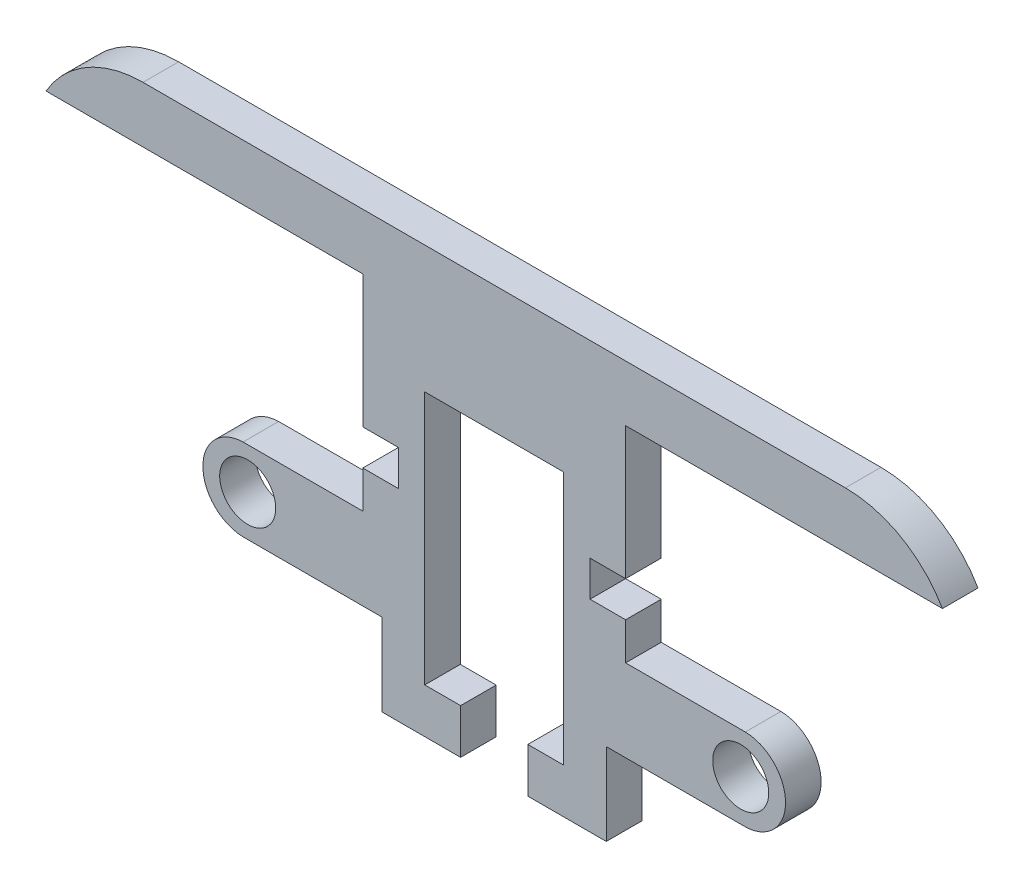
ISO-10303-21;
HEADER;
FILE_DESCRIPTION(('STEP AP214'),'2;1');
FILE_NAME('part.step','',(''),(''),'','','');
FILE_SCHEMA(('AUTOMOTIVE_DESIGN { 1 0 10303 214 1 1 1 1 }'));
ENDSEC;
DATA;
#1=APPLICATION_CONTEXT('core data for automotive mechanical design processes');
#2=APPLICATION_PROTOCOL_DEFINITION('international standard','automotive_design',2000,#1);
#3=PRODUCT_CONTEXT('',#1,'mechanical');
#4=PRODUCT('Part','Part','',(#3));
#5=PRODUCT_RELATED_PRODUCT_CATEGORY('part','',(#4));
#6=PRODUCT_DEFINITION_FORMATION('','',#4);
#7=PRODUCT_DEFINITION_CONTEXT('part definition',#1,'design');
#8=PRODUCT_DEFINITION('design','',#6,#7);
#9=PRODUCT_DEFINITION_SHAPE('','',#8);
#10=(LENGTH_UNIT() NAMED_UNIT(*) SI_UNIT(.MILLI.,.METRE.));
#11=(NAMED_UNIT(*) PLANE_ANGLE_UNIT() SI_UNIT($,.RADIAN.));
#12=(NAMED_UNIT(*) SI_UNIT($,.STERADIAN.) SOLID_ANGLE_UNIT());
#13=UNCERTAINTY_MEASURE_WITH_UNIT(LENGTH_MEASURE(1.E-05),#10,'distance_accuracy_value','');
#14=(GEOMETRIC_REPRESENTATION_CONTEXT(3) GLOBAL_UNCERTAINTY_ASSIGNED_CONTEXT((#13)) GLOBAL_UNIT_ASSIGNED_CONTEXT((#10,
#11,#12)) REPRESENTATION_CONTEXT('',''));
#15=CARTESIAN_POINT('',(0.,0.,0.));
#16=DIRECTION('',(0.,0.,1.));
#17=DIRECTION('',(1.,0.,0.));
#18=AXIS2_PLACEMENT_3D('',#15,#16,#17);
#19=CARTESIAN_POINT('',(0.,0.,3.175));
#20=DIRECTION('',(0.,0.,1.));
#21=DIRECTION('',(1.,0.,0.));
#22=AXIS2_PLACEMENT_3D('',#19,#20,#21);
#23=PLANE('',#22);
#24=CARTESIAN_POINT('',(-21.9999999999741,52.5623633111844,3.175));
#25=DIRECTION('',(0.,0.,1.));
#26=DIRECTION('',(1.,0.,0.));
#27=AXIS2_PLACEMENT_3D('',#24,#25,#26);
#28=CIRCLE('',#27,2.50000000002668);
#29=CARTESIAN_POINT('',(-19.4999999999474,52.5623633111844,3.175));
#30=VERTEX_POINT('',#29);
#31=EDGE_CURVE('E313',#30,#30,#28,.F.);
#32=ORIENTED_EDGE('',*,*,#31,.T.);
#33=EDGE_LOOP('',(#32));
#34=FACE_BOUND('',#33,.T.);
#35=CARTESIAN_POINT('',(21.9999999999741,52.5623633111844,3.175));
#36=DIRECTION('',(0.,0.,1.));
#37=DIRECTION('',(1.,0.,0.));
#38=AXIS2_PLACEMENT_3D('',#35,#36,#37);
#39=CIRCLE('',#38,2.50000000002668);
#40=CARTESIAN_POINT('',(24.5000000000008,52.5623633111844,3.175));
#41=VERTEX_POINT('',#40);
#42=EDGE_CURVE('E316',#41,#41,#39,.T.);
#43=ORIENTED_EDGE('',*,*,#42,.F.);
#44=EDGE_LOOP('',(#43));
#45=FACE_BOUND('',#44,.T.);
#46=DIRECTION('',(-1.,0.,0.));
#47=VECTOR('',#46,1.);
#48=CARTESIAN_POINT('',(0.,45.5623633111909,3.175));
#49=LINE('',#48,#47);
#50=CARTESIAN_POINT('',(6.2,45.5623633111909,3.175));
#51=VERTEX_POINT('',#50);
#52=CARTESIAN_POINT('',(3.,45.5623633111909,3.175));
#53=VERTEX_POINT('',#52);
#54=EDGE_CURVE('E282',#51,#53,#49,.T.);
#55=ORIENTED_EDGE('',*,*,#54,.T.);
#56=DIRECTION('',(0.,-1.,0.));
#57=VECTOR('',#56,1.);
#58=CARTESIAN_POINT('',(3.00000000000001,0.,3.175));
#59=LINE('',#58,#57);
#60=CARTESIAN_POINT('',(3.,41.5623633111909,3.175));
#61=VERTEX_POINT('',#60);
#62=EDGE_CURVE('E279',#53,#61,#59,.T.);
#63=ORIENTED_EDGE('',*,*,#62,.T.);
#64=DIRECTION('',(-1.,0.,0.));
#65=VECTOR('',#64,1.);
#66=CARTESIAN_POINT('',(0.,41.5623633111909,3.175));
#67=LINE('',#66,#65);
#68=CARTESIAN_POINT('',(10.,41.5623633111909,3.175));
#69=VERTEX_POINT('',#68);
#70=EDGE_CURVE('E309',#69,#61,#67,.T.);
#71=ORIENTED_EDGE('',*,*,#70,.F.);
#72=DIRECTION('',(0.,1.,0.));
#73=VECTOR('',#72,1.);
#74=CARTESIAN_POINT('',(10.,0.,3.175));
#75=LINE('',#74,#73);
#76=CARTESIAN_POINT('',(10.,48.895776139648,3.175));
#77=VERTEX_POINT('',#76);
#78=EDGE_CURVE('E330',#69,#77,#75,.T.);
#79=ORIENTED_EDGE('',*,*,#78,.T.);
#80=DIRECTION('',(1.,0.,0.));
#81=VECTOR('',#80,1.);
#82=CARTESIAN_POINT('',(0.,48.8957761396479,3.175));
#83=LINE('',#82,#81);
#84=CARTESIAN_POINT('',(22.4102695232923,48.895776139648,3.175));
#85=VERTEX_POINT('',#84);
#86=EDGE_CURVE('E332',#77,#85,#83,.T.);
#87=ORIENTED_EDGE('',*,*,#86,.T.);
#88=CARTESIAN_POINT('',(22.3325900721465,52.5623633111844,3.175));
#89=DIRECTION('',(0.,0.,1.));
#90=DIRECTION('',(1.,0.,0.));
#91=AXIS2_PLACEMENT_3D('',#88,#89,#90);
#92=CIRCLE('',#91,3.66740992849261);
#93=CARTESIAN_POINT('',(22.4102695232923,56.2289504827209,3.175));
#94=VERTEX_POINT('',#93);
#95=EDGE_CURVE('E334',#94,#85,#92,.F.);
#96=ORIENTED_EDGE('',*,*,#95,.F.);
#97=DIRECTION('',(1.,0.,0.));
#98=VECTOR('',#97,1.);
#99=CARTESIAN_POINT('',(0.,56.2289504827209,3.175));
#100=LINE('',#99,#98);
#101=CARTESIAN_POINT('',(11.7277945466856,56.2289504827209,3.175));
#102=VERTEX_POINT('',#101);
#103=EDGE_CURVE('E337',#102,#94,#100,.T.);
#104=ORIENTED_EDGE('',*,*,#103,.F.);
#105=DIRECTION('',(0.,-1.,0.));
#106=VECTOR('',#105,1.);
#107=CARTESIAN_POINT('',(11.7277945466856,0.,3.175));
#108=LINE('',#107,#106);
#109=CARTESIAN_POINT('',(11.7277945466856,59.5623633111909,3.175));
#110=VERTEX_POINT('',#109);
#111=EDGE_CURVE('E340',#110,#102,#108,.T.);
#112=ORIENTED_EDGE('',*,*,#111,.F.);
#113=DIRECTION('',(1.,0.,0.));
#114=VECTOR('',#113,1.);
#115=CARTESIAN_POINT('',(0.,59.5623633111909,3.175));
#116=LINE('',#115,#114);
#117=CARTESIAN_POINT('',(8.55279454668558,59.5623633111909,3.175));
#118=VERTEX_POINT('',#117);
#119=EDGE_CURVE('E343',#118,#110,#116,.T.);
#120=ORIENTED_EDGE('',*,*,#119,.F.);
#121=DIRECTION('',(0.,1.,0.));
#122=VECTOR('',#121,1.);
#123=CARTESIAN_POINT('',(8.55279454668558,0.,3.175));
#124=LINE('',#123,#122);
#125=CARTESIAN_POINT('',(8.55279454668558,62.7373633111909,3.175));
#126=VERTEX_POINT('',#125);
#127=EDGE_CURVE('E346',#118,#126,#124,.T.);
#128=ORIENTED_EDGE('',*,*,#127,.T.);
#129=DIRECTION('',(1.,0.,0.));
#130=VECTOR('',#129,1.);
#131=CARTESIAN_POINT('',(0.,62.7373633111909,3.175));
#132=LINE('',#131,#130);
#133=CARTESIAN_POINT('',(11.7277945466856,62.7373633111909,3.175));
#134=VERTEX_POINT('',#133);
#135=EDGE_CURVE('E348',#126,#134,#132,.T.);
#136=ORIENTED_EDGE('',*,*,#135,.T.);
#137=DIRECTION('',(0.,1.,0.));
#138=VECTOR('',#137,1.);
#139=CARTESIAN_POINT('',(11.7277945466856,0.,3.175));
#140=LINE('',#139,#138);
#141=CARTESIAN_POINT('',(11.7277945466856,74.5623633111909,3.175));
#142=VERTEX_POINT('',#141);
#143=EDGE_CURVE('E350',#134,#142,#140,.T.);
#144=ORIENTED_EDGE('',*,*,#143,.T.);
#145=DIRECTION('',(1.,0.,0.));
#146=VECTOR('',#145,1.);
#147=CARTESIAN_POINT('',(0.,74.5623633111909,3.175));
#148=LINE('',#147,#146);
#149=CARTESIAN_POINT('',(40.,74.5623633111909,3.175));
#150=VERTEX_POINT('',#149);
#151=EDGE_CURVE('E352',#142,#150,#148,.T.);
#152=ORIENTED_EDGE('',*,*,#151,.T.);
#153=CARTESIAN_POINT('',(31.3397459621556,69.5623633111909,3.175));
#154=DIRECTION('',(0.,0.,1.));
#155=DIRECTION('',(1.,0.,0.));
#156=AXIS2_PLACEMENT_3D('',#153,#154,#155);
#157=CIRCLE('',#156,10.);
#158=CARTESIAN_POINT('',(31.3397459621556,79.5623633111909,3.175));
#159=VERTEX_POINT('',#158);
#160=EDGE_CURVE('E493',#150,#159,#157,.T.);
#161=ORIENTED_EDGE('',*,*,#160,.T.);
#162=DIRECTION('',(1.,0.,0.));
#163=VECTOR('',#162,1.);
#164=CARTESIAN_POINT('',(0.,79.5623633111909,3.175));
#165=LINE('',#164,#163);
#166=CARTESIAN_POINT('',(-31.3397459621556,79.5623633111909,3.175));
#167=VERTEX_POINT('',#166);
#168=EDGE_CURVE('E354',#167,#159,#165,.T.);
#169=ORIENTED_EDGE('',*,*,#168,.F.);
#170=CARTESIAN_POINT('',(-31.3397459621556,69.5623633111909,3.175));
#171=DIRECTION('',(0.,0.,1.));
#172=DIRECTION('',(1.,0.,0.));
#173=AXIS2_PLACEMENT_3D('',#170,#171,#172);
#174=CIRCLE('',#173,10.);
#175=CARTESIAN_POINT('',(-40.,74.5623633111909,3.175));
#176=VERTEX_POINT('',#175);
#177=EDGE_CURVE('E494',#167,#176,#174,.T.);
#178=ORIENTED_EDGE('',*,*,#177,.T.);
#179=DIRECTION('',(-1.,0.,0.));
#180=VECTOR('',#179,1.);
#181=CARTESIAN_POINT('',(0.,74.5623633111909,3.175));
#182=LINE('',#181,#180);
#183=CARTESIAN_POINT('',(-11.7277945466856,74.5623633111909,3.175));
#184=VERTEX_POINT('',#183);
#185=EDGE_CURVE('E357',#184,#176,#182,.T.);
#186=ORIENTED_EDGE('',*,*,#185,.F.);
#187=DIRECTION('',(0.,1.,0.));
#188=VECTOR('',#187,1.);
#189=CARTESIAN_POINT('',(-11.7277945466856,0.,3.175));
#190=LINE('',#189,#188);
#191=CARTESIAN_POINT('',(-11.7277945466856,62.7373633111909,3.175));
#192=VERTEX_POINT('',#191);
#193=EDGE_CURVE('E360',#192,#184,#190,.T.);
#194=ORIENTED_EDGE('',*,*,#193,.F.);
#195=DIRECTION('',(-1.,0.,0.));
#196=VECTOR('',#195,1.);
#197=CARTESIAN_POINT('',(0.,62.7373633111909,3.175));
#198=LINE('',#197,#196);
#199=CARTESIAN_POINT('',(-8.55279454668558,62.7373633111909,3.175));
#200=VERTEX_POINT('',#199);
#201=EDGE_CURVE('E363',#200,#192,#198,.T.);
#202=ORIENTED_EDGE('',*,*,#201,.F.);
#203=DIRECTION('',(0.,1.,0.));
#204=VECTOR('',#203,1.);
#205=CARTESIAN_POINT('',(-8.55279454668552,0.,3.175));
#206=LINE('',#205,#204);
#207=CARTESIAN_POINT('',(-8.55279454668558,59.5623633111909,3.175));
#208=VERTEX_POINT('',#207);
#209=EDGE_CURVE('E366',#208,#200,#206,.T.);
#210=ORIENTED_EDGE('',*,*,#209,.F.);
#211=DIRECTION('',(1.,0.,0.));
#212=VECTOR('',#211,1.);
#213=CARTESIAN_POINT('',(0.,59.5623633111909,3.175));
#214=LINE('',#213,#212);
#215=CARTESIAN_POINT('',(-11.7277945466856,59.5623633111909,3.175));
#216=VERTEX_POINT('',#215);
#217=EDGE_CURVE('E369',#216,#208,#214,.T.);
#218=ORIENTED_EDGE('',*,*,#217,.F.);
#219=DIRECTION('',(0.,-1.,0.));
#220=VECTOR('',#219,1.);
#221=CARTESIAN_POINT('',(-11.7277945466856,0.,3.175));
#222=LINE('',#221,#220);
#223=CARTESIAN_POINT('',(-11.7277945466856,56.2289504827209,3.175));
#224=VERTEX_POINT('',#223);
#225=EDGE_CURVE('E372',#216,#224,#222,.T.);
#226=ORIENTED_EDGE('',*,*,#225,.T.);
#227=DIRECTION('',(-1.,0.,0.));
#228=VECTOR('',#227,1.);
#229=CARTESIAN_POINT('',(0.,56.2289504827209,3.175));
#230=LINE('',#229,#228);
#231=CARTESIAN_POINT('',(-22.4102695232923,56.2289504827209,3.175));
#232=VERTEX_POINT('',#231);
#233=EDGE_CURVE('E320',#224,#232,#230,.T.);
#234=ORIENTED_EDGE('',*,*,#233,.T.);
#235=CARTESIAN_POINT('',(-22.3325900721465,52.5623633111844,3.175));
#236=DIRECTION('',(0.,0.,1.));
#237=DIRECTION('',(1.,0.,0.));
#238=AXIS2_PLACEMENT_3D('',#235,#236,#237);
#239=CIRCLE('',#238,3.66740992849261);
#240=CARTESIAN_POINT('',(-22.4102695232923,48.895776139648,3.175));
#241=VERTEX_POINT('',#240);
#242=EDGE_CURVE('E323',#232,#241,#239,.T.);
#243=ORIENTED_EDGE('',*,*,#242,.T.);
#244=DIRECTION('',(-1.,0.,0.));
#245=VECTOR('',#244,1.);
#246=CARTESIAN_POINT('',(0.,48.8957761396479,3.175));
#247=LINE('',#246,#245);
#248=CARTESIAN_POINT('',(-10.,48.895776139648,3.175));
#249=VERTEX_POINT('',#248);
#250=EDGE_CURVE('E325',#249,#241,#247,.T.);
#251=ORIENTED_EDGE('',*,*,#250,.F.);
#252=DIRECTION('',(0.,1.,0.));
#253=VECTOR('',#252,1.);
#254=CARTESIAN_POINT('',(-9.99999999999997,0.,3.175));
#255=LINE('',#254,#253);
#256=CARTESIAN_POINT('',(-9.99999999999999,41.5623633111909,3.175));
#257=VERTEX_POINT('',#256);
#258=EDGE_CURVE('E328',#257,#249,#255,.T.);
#259=ORIENTED_EDGE('',*,*,#258,.F.);
#260=CARTESIAN_POINT('',(-2.99999999999999,41.5623633111909,3.175));
#261=VERTEX_POINT('',#260);
#262=EDGE_CURVE('E308',#261,#257,#67,.T.);
#263=ORIENTED_EDGE('',*,*,#262,.F.);
#264=DIRECTION('',(0.,-1.,0.));
#265=VECTOR('',#264,1.);
#266=CARTESIAN_POINT('',(-2.99999999999999,0.,3.175));
#267=LINE('',#266,#265);
#268=CARTESIAN_POINT('',(-2.99999999999999,45.5623633111909,3.175));
#269=VERTEX_POINT('',#268);
#270=EDGE_CURVE('E50',#269,#261,#267,.T.);
#271=ORIENTED_EDGE('',*,*,#270,.F.);
#272=DIRECTION('',(1.,0.,0.));
#273=VECTOR('',#272,1.);
#274=CARTESIAN_POINT('',(0.,45.5623633111909,3.175));
#275=LINE('',#274,#273);
#276=CARTESIAN_POINT('',(-6.2,45.5623633111909,3.175));
#277=VERTEX_POINT('',#276);
#278=EDGE_CURVE('E251',#277,#269,#275,.T.);
#279=ORIENTED_EDGE('',*,*,#278,.F.);
#280=DIRECTION('',(0.,-1.,0.));
#281=VECTOR('',#280,1.);
#282=CARTESIAN_POINT('',(-6.19999999999999,0.,3.175));
#283=LINE('',#282,#281);
#284=CARTESIAN_POINT('',(-6.2,68.2123633111909,3.175));
#285=VERTEX_POINT('',#284);
#286=EDGE_CURVE('E263',#285,#277,#283,.T.);
#287=ORIENTED_EDGE('',*,*,#286,.F.);
#288=DIRECTION('',(1.,0.,0.));
#289=VECTOR('',#288,1.);
#290=CARTESIAN_POINT('',(0.,68.2123633111909,3.175));
#291=LINE('',#290,#289);
#292=CARTESIAN_POINT('',(6.2,68.2123633111909,3.175));
#293=VERTEX_POINT('',#292);
#294=EDGE_CURVE('E266',#285,#293,#291,.T.);
#295=ORIENTED_EDGE('',*,*,#294,.T.);
#296=DIRECTION('',(0.,-1.,0.));
#297=VECTOR('',#296,1.);
#298=CARTESIAN_POINT('',(6.20000000000001,0.,3.175));
#299=LINE('',#298,#297);
#300=EDGE_CURVE('E285',#293,#51,#299,.T.);
#301=ORIENTED_EDGE('',*,*,#300,.T.);
#302=EDGE_LOOP('',(#55,#63,#71,#79,#87,#96,#104,#112,#120,#128,#136,#144,#152,#161,#169,#178,
#186,#194,#202,#210,#218,#226,#234,#243,#251,#259,#263,#271,#279,#287,#295,#301));
#303=FACE_BOUND('',#302,.T.);
#304=ADVANCED_FACE('F35',(#34,#45,#303),#23,.T.);
#305=CARTESIAN_POINT('',(0.,0.,0.));
#306=DIRECTION('',(0.,0.,1.));
#307=DIRECTION('',(1.,0.,0.));
#308=AXIS2_PLACEMENT_3D('',#305,#306,#307);
#309=PLANE('',#308);
#310=CARTESIAN_POINT('',(21.9999999999741,52.5623633111844,0.));
#311=DIRECTION('',(0.,0.,1.));
#312=DIRECTION('',(1.,0.,0.));
#313=AXIS2_PLACEMENT_3D('',#310,#311,#312);
#314=CIRCLE('',#313,2.50000000002668);
#315=CARTESIAN_POINT('',(24.5000000000008,52.5623633111844,0.));
#316=VERTEX_POINT('',#315);
#317=EDGE_CURVE('E377',#316,#316,#314,.T.);
#318=ORIENTED_EDGE('',*,*,#317,.T.);
#319=EDGE_LOOP('',(#318));
#320=FACE_BOUND('',#319,.T.);
#321=CARTESIAN_POINT('',(-21.9999999999741,52.5623633111844,0.));
#322=DIRECTION('',(0.,0.,1.));
#323=DIRECTION('',(1.,0.,0.));
#324=AXIS2_PLACEMENT_3D('',#321,#322,#323);
#325=CIRCLE('',#324,2.50000000002668);
#326=CARTESIAN_POINT('',(-19.4999999999474,52.5623633111844,0.));
#327=VERTEX_POINT('',#326);
#328=EDGE_CURVE('E312',#327,#327,#325,.F.);
#329=ORIENTED_EDGE('',*,*,#328,.F.);
#330=EDGE_LOOP('',(#329));
#331=FACE_BOUND('',#330,.T.);
#332=DIRECTION('',(0.,-1.,0.));
#333=VECTOR('',#332,1.);
#334=CARTESIAN_POINT('',(3.00000000000001,0.,0.));
#335=LINE('',#334,#333);
#336=CARTESIAN_POINT('',(3.,45.5623633111909,0.));
#337=VERTEX_POINT('',#336);
#338=CARTESIAN_POINT('',(3.,41.5623633111909,0.));
#339=VERTEX_POINT('',#338);
#340=EDGE_CURVE('E257',#337,#339,#335,.T.);
#341=ORIENTED_EDGE('',*,*,#340,.F.);
#342=DIRECTION('',(-1.,0.,0.));
#343=VECTOR('',#342,1.);
#344=CARTESIAN_POINT('',(0.,45.5623633111909,0.));
#345=LINE('',#344,#343);
#346=CARTESIAN_POINT('',(6.2,45.5623633111909,0.));
#347=VERTEX_POINT('',#346);
#348=EDGE_CURVE('E270',#347,#337,#345,.T.);
#349=ORIENTED_EDGE('',*,*,#348,.F.);
#350=DIRECTION('',(0.,-1.,0.));
#351=VECTOR('',#350,1.);
#352=CARTESIAN_POINT('',(6.20000000000001,0.,0.));
#353=LINE('',#352,#351);
#354=CARTESIAN_POINT('',(6.2,68.2123633111909,0.));
#355=VERTEX_POINT('',#354);
#356=EDGE_CURVE('E272',#355,#347,#353,.T.);
#357=ORIENTED_EDGE('',*,*,#356,.F.);
#358=DIRECTION('',(1.,0.,0.));
#359=VECTOR('',#358,1.);
#360=CARTESIAN_POINT('',(0.,68.2123633111909,0.));
#361=LINE('',#360,#359);
#362=CARTESIAN_POINT('',(-6.2,68.2123633111909,0.));
#363=VERTEX_POINT('',#362);
#364=EDGE_CURVE('E274',#363,#355,#361,.T.);
#365=ORIENTED_EDGE('',*,*,#364,.F.);
#366=DIRECTION('',(0.,-1.,0.));
#367=VECTOR('',#366,1.);
#368=CARTESIAN_POINT('',(-6.19999999999999,0.,0.));
#369=LINE('',#368,#367);
#370=CARTESIAN_POINT('',(-6.2,45.5623633111909,0.));
#371=VERTEX_POINT('',#370);
#372=EDGE_CURVE('E253',#363,#371,#369,.T.);
#373=ORIENTED_EDGE('',*,*,#372,.T.);
#374=DIRECTION('',(1.,0.,0.));
#375=VECTOR('',#374,1.);
#376=CARTESIAN_POINT('',(0.,45.5623633111909,0.));
#377=LINE('',#376,#375);
#378=CARTESIAN_POINT('',(-2.99999999999999,45.5623633111909,0.));
#379=VERTEX_POINT('',#378);
#380=EDGE_CURVE('E248',#371,#379,#377,.T.);
#381=ORIENTED_EDGE('',*,*,#380,.T.);
#382=DIRECTION('',(0.,-1.,0.));
#383=VECTOR('',#382,1.);
#384=CARTESIAN_POINT('',(-2.99999999999999,0.,0.));
#385=LINE('',#384,#383);
#386=CARTESIAN_POINT('',(-2.99999999999999,41.5623633111909,0.));
#387=VERTEX_POINT('',#386);
#388=EDGE_CURVE('E255',#379,#387,#385,.T.);
#389=ORIENTED_EDGE('',*,*,#388,.T.);
#390=DIRECTION('',(-1.,0.,0.));
#391=VECTOR('',#390,1.);
#392=CARTESIAN_POINT('',(0.,41.5623633111909,0.));
#393=LINE('',#392,#391);
#394=CARTESIAN_POINT('',(-9.99999999999999,41.5623633111909,0.));
#395=VERTEX_POINT('',#394);
#396=EDGE_CURVE('E43',#387,#395,#393,.T.);
#397=ORIENTED_EDGE('',*,*,#396,.T.);
#398=DIRECTION('',(0.,1.,0.));
#399=VECTOR('',#398,1.);
#400=CARTESIAN_POINT('',(-9.99999999999997,0.,0.));
#401=LINE('',#400,#399);
#402=CARTESIAN_POINT('',(-10.,48.895776139648,0.));
#403=VERTEX_POINT('',#402);
#404=EDGE_CURVE('E389',#395,#403,#401,.T.);
#405=ORIENTED_EDGE('',*,*,#404,.T.);
#406=DIRECTION('',(-1.,0.,0.));
#407=VECTOR('',#406,1.);
#408=CARTESIAN_POINT('',(0.,48.8957761396479,0.));
#409=LINE('',#408,#407);
#410=CARTESIAN_POINT('',(-22.4102695232923,48.895776139648,0.));
#411=VERTEX_POINT('',#410);
#412=EDGE_CURVE('E386',#403,#411,#409,.T.);
#413=ORIENTED_EDGE('',*,*,#412,.T.);
#414=CARTESIAN_POINT('',(-22.3325900721465,52.5623633111844,0.));
#415=DIRECTION('',(0.,0.,1.));
#416=DIRECTION('',(1.,0.,0.));
#417=AXIS2_PLACEMENT_3D('',#414,#415,#416);
#418=CIRCLE('',#417,3.66740992849261);
#419=CARTESIAN_POINT('',(-22.4102695232923,56.2289504827209,0.));
#420=VERTEX_POINT('',#419);
#421=EDGE_CURVE('E383',#420,#411,#418,.T.);
#422=ORIENTED_EDGE('',*,*,#421,.F.);
#423=DIRECTION('',(-1.,0.,0.));
#424=VECTOR('',#423,1.);
#425=CARTESIAN_POINT('',(0.,56.2289504827209,0.));
#426=LINE('',#425,#424);
#427=CARTESIAN_POINT('',(-11.7277945466856,56.2289504827209,0.));
#428=VERTEX_POINT('',#427);
#429=EDGE_CURVE('E380',#428,#420,#426,.T.);
#430=ORIENTED_EDGE('',*,*,#429,.F.);
#431=DIRECTION('',(0.,-1.,0.));
#432=VECTOR('',#431,1.);
#433=CARTESIAN_POINT('',(-11.7277945466856,0.,0.));
#434=LINE('',#433,#432);
#435=CARTESIAN_POINT('',(-11.7277945466856,59.5623633111909,0.));
#436=VERTEX_POINT('',#435);
#437=EDGE_CURVE('E317',#436,#428,#434,.T.);
#438=ORIENTED_EDGE('',*,*,#437,.F.);
#439=DIRECTION('',(1.,0.,0.));
#440=VECTOR('',#439,1.);
#441=CARTESIAN_POINT('',(0.,59.5623633111909,0.));
#442=LINE('',#441,#440);
#443=CARTESIAN_POINT('',(-8.55279454668558,59.5623633111909,0.));
#444=VERTEX_POINT('',#443);
#445=EDGE_CURVE('E432',#436,#444,#442,.T.);
#446=ORIENTED_EDGE('',*,*,#445,.T.);
#447=DIRECTION('',(0.,1.,0.));
#448=VECTOR('',#447,1.);
#449=CARTESIAN_POINT('',(-8.55279454668552,0.,0.));
#450=LINE('',#449,#448);
#451=CARTESIAN_POINT('',(-8.55279454668558,62.7373633111909,0.));
#452=VERTEX_POINT('',#451);
#453=EDGE_CURVE('E429',#444,#452,#450,.T.);
#454=ORIENTED_EDGE('',*,*,#453,.T.);
#455=DIRECTION('',(-1.,0.,0.));
#456=VECTOR('',#455,1.);
#457=CARTESIAN_POINT('',(0.,62.7373633111909,0.));
#458=LINE('',#457,#456);
#459=CARTESIAN_POINT('',(-11.7277945466856,62.7373633111909,0.));
#460=VERTEX_POINT('',#459);
#461=EDGE_CURVE('E426',#452,#460,#458,.T.);
#462=ORIENTED_EDGE('',*,*,#461,.T.);
#463=DIRECTION('',(0.,1.,0.));
#464=VECTOR('',#463,1.);
#465=CARTESIAN_POINT('',(-11.7277945466856,0.,0.));
#466=LINE('',#465,#464);
#467=CARTESIAN_POINT('',(-11.7277945466856,74.5623633111909,0.));
#468=VERTEX_POINT('',#467);
#469=EDGE_CURVE('E423',#460,#468,#466,.T.);
#470=ORIENTED_EDGE('',*,*,#469,.T.);
#471=DIRECTION('',(-1.,0.,0.));
#472=VECTOR('',#471,1.);
#473=CARTESIAN_POINT('',(0.,74.5623633111909,0.));
#474=LINE('',#473,#472);
#475=CARTESIAN_POINT('',(-40.,74.5623633111909,0.));
#476=VERTEX_POINT('',#475);
#477=EDGE_CURVE('E420',#468,#476,#474,.T.);
#478=ORIENTED_EDGE('',*,*,#477,.T.);
#479=CARTESIAN_POINT('',(-31.3397459621556,69.5623633111909,0.));
#480=DIRECTION('',(0.,0.,1.));
#481=DIRECTION('',(1.,0.,0.));
#482=AXIS2_PLACEMENT_3D('',#479,#480,#481);
#483=CIRCLE('',#482,10.);
#484=CARTESIAN_POINT('',(-31.3397459621556,79.5623633111909,0.));
#485=VERTEX_POINT('',#484);
#486=EDGE_CURVE('E486',#476,#485,#483,.F.);
#487=ORIENTED_EDGE('',*,*,#486,.T.);
#488=DIRECTION('',(1.,0.,0.));
#489=VECTOR('',#488,1.);
#490=CARTESIAN_POINT('',(0.,79.5623633111909,0.));
#491=LINE('',#490,#489);
#492=CARTESIAN_POINT('',(31.3397459621556,79.5623633111909,0.));
#493=VERTEX_POINT('',#492);
#494=EDGE_CURVE('E417',#485,#493,#491,.T.);
#495=ORIENTED_EDGE('',*,*,#494,.T.);
#496=CARTESIAN_POINT('',(31.3397459621556,69.5623633111909,0.));
#497=DIRECTION('',(0.,0.,1.));
#498=DIRECTION('',(1.,0.,0.));
#499=AXIS2_PLACEMENT_3D('',#496,#497,#498);
#500=CIRCLE('',#499,10.);
#501=CARTESIAN_POINT('',(40.,74.5623633111909,0.));
#502=VERTEX_POINT('',#501);
#503=EDGE_CURVE('E484',#493,#502,#500,.F.);
#504=ORIENTED_EDGE('',*,*,#503,.T.);
#505=DIRECTION('',(1.,0.,0.));
#506=VECTOR('',#505,1.);
#507=CARTESIAN_POINT('',(0.,74.5623633111909,0.));
#508=LINE('',#507,#506);
#509=CARTESIAN_POINT('',(11.7277945466856,74.5623633111909,0.));
#510=VERTEX_POINT('',#509);
#511=EDGE_CURVE('E414',#510,#502,#508,.T.);
#512=ORIENTED_EDGE('',*,*,#511,.F.);
#513=DIRECTION('',(0.,1.,0.));
#514=VECTOR('',#513,1.);
#515=CARTESIAN_POINT('',(11.7277945466856,0.,0.));
#516=LINE('',#515,#514);
#517=CARTESIAN_POINT('',(11.7277945466856,62.7373633111909,0.));
#518=VERTEX_POINT('',#517);
#519=EDGE_CURVE('E412',#518,#510,#516,.T.);
#520=ORIENTED_EDGE('',*,*,#519,.F.);
#521=DIRECTION('',(1.,0.,0.));
#522=VECTOR('',#521,1.);
#523=CARTESIAN_POINT('',(0.,62.7373633111909,0.));
#524=LINE('',#523,#522);
#525=CARTESIAN_POINT('',(8.55279454668558,62.7373633111909,0.));
#526=VERTEX_POINT('',#525);
#527=EDGE_CURVE('E410',#526,#518,#524,.T.);
#528=ORIENTED_EDGE('',*,*,#527,.F.);
#529=DIRECTION('',(0.,1.,0.));
#530=VECTOR('',#529,1.);
#531=CARTESIAN_POINT('',(8.55279454668558,0.,0.));
#532=LINE('',#531,#530);
#533=CARTESIAN_POINT('',(8.55279454668558,59.5623633111909,0.));
#534=VERTEX_POINT('',#533);
#535=EDGE_CURVE('E408',#534,#526,#532,.T.);
#536=ORIENTED_EDGE('',*,*,#535,.F.);
#537=DIRECTION('',(1.,0.,0.));
#538=VECTOR('',#537,1.);
#539=CARTESIAN_POINT('',(0.,59.5623633111909,0.));
#540=LINE('',#539,#538);
#541=CARTESIAN_POINT('',(11.7277945466856,59.5623633111909,0.));
#542=VERTEX_POINT('',#541);
#543=EDGE_CURVE('E405',#534,#542,#540,.T.);
#544=ORIENTED_EDGE('',*,*,#543,.T.);
#545=DIRECTION('',(0.,-1.,0.));
#546=VECTOR('',#545,1.);
#547=CARTESIAN_POINT('',(11.7277945466856,0.,0.));
#548=LINE('',#547,#546);
#549=CARTESIAN_POINT('',(11.7277945466856,56.2289504827209,0.));
#550=VERTEX_POINT('',#549);
#551=EDGE_CURVE('E402',#542,#550,#548,.T.);
#552=ORIENTED_EDGE('',*,*,#551,.T.);
#553=DIRECTION('',(1.,0.,0.));
#554=VECTOR('',#553,1.);
#555=CARTESIAN_POINT('',(0.,56.2289504827209,0.));
#556=LINE('',#555,#554);
#557=CARTESIAN_POINT('',(22.4102695232923,56.2289504827209,0.));
#558=VERTEX_POINT('',#557);
#559=EDGE_CURVE('E399',#550,#558,#556,.T.);
#560=ORIENTED_EDGE('',*,*,#559,.T.);
#561=CARTESIAN_POINT('',(22.3325900721465,52.5623633111844,0.));
#562=DIRECTION('',(0.,0.,1.));
#563=DIRECTION('',(1.,0.,0.));
#564=AXIS2_PLACEMENT_3D('',#561,#562,#563);
#565=CIRCLE('',#564,3.66740992849261);
#566=CARTESIAN_POINT('',(22.4102695232923,48.895776139648,0.));
#567=VERTEX_POINT('',#566);
#568=EDGE_CURVE('E396',#558,#567,#565,.F.);
#569=ORIENTED_EDGE('',*,*,#568,.T.);
#570=DIRECTION('',(1.,0.,0.));
#571=VECTOR('',#570,1.);
#572=CARTESIAN_POINT('',(0.,48.8957761396479,0.));
#573=LINE('',#572,#571);
#574=CARTESIAN_POINT('',(10.,48.895776139648,0.));
#575=VERTEX_POINT('',#574);
#576=EDGE_CURVE('E393',#575,#567,#573,.T.);
#577=ORIENTED_EDGE('',*,*,#576,.F.);
#578=DIRECTION('',(0.,1.,0.));
#579=VECTOR('',#578,1.);
#580=CARTESIAN_POINT('',(10.,0.,0.));
#581=LINE('',#580,#579);
#582=CARTESIAN_POINT('',(10.,41.5623633111909,0.));
#583=VERTEX_POINT('',#582);
#584=EDGE_CURVE('E391',#583,#575,#581,.T.);
#585=ORIENTED_EDGE('',*,*,#584,.F.);
#586=EDGE_CURVE('E12',#583,#339,#393,.T.);
#587=ORIENTED_EDGE('',*,*,#586,.T.);
#588=EDGE_LOOP('',(#341,#349,#357,#365,#373,#381,#389,#397,#405,#413,#422,#430,#438,#446,#454,
#462,#470,#478,#487,#495,#504,#512,#520,#528,#536,#544,#552,#560,#569,#577,#585,#587));
#589=FACE_BOUND('',#588,.T.);
#590=ADVANCED_FACE('F260',(#320,#331,#589),#309,.F.);
#591=CARTESIAN_POINT('',(0.,41.5623633111909,0.));
#592=DIRECTION('',(0.,1.,0.));
#593=DIRECTION('',(0.,0.,1.));
#594=AXIS2_PLACEMENT_3D('',#591,#592,#593);
#595=PLANE('',#594);
#596=DIRECTION('',(0.,0.,1.));
#597=VECTOR('',#596,1.);
#598=CARTESIAN_POINT('',(3.,41.5623633111909,0.));
#599=LINE('',#598,#597);
#600=EDGE_CURVE('E301',#339,#61,#599,.T.);
#601=ORIENTED_EDGE('',*,*,#600,.F.);
#602=ORIENTED_EDGE('',*,*,#586,.F.);
#603=DIRECTION('',(0.,0.,-1.));
#604=VECTOR('',#603,1.);
#605=CARTESIAN_POINT('',(10.,41.5623633111909,3.175));
#606=LINE('',#605,#604);
#607=EDGE_CURVE('E292',#69,#583,#606,.T.);
#608=ORIENTED_EDGE('',*,*,#607,.F.);
#609=ORIENTED_EDGE('',*,*,#70,.T.);
#610=EDGE_LOOP('',(#601,#602,#608,#609));
#611=FACE_BOUND('',#610,.T.);
#612=ADVANCED_FACE('F562',(#611),#595,.F.);
#613=CARTESIAN_POINT('',(0.,56.2289504827209,3.175));
#614=DIRECTION('',(0.,-1.,0.));
#615=DIRECTION('',(1.,0.,0.));
#616=AXIS2_PLACEMENT_3D('',#613,#614,#615);
#617=PLANE('',#616);
#618=ORIENTED_EDGE('',*,*,#429,.T.);
#619=DIRECTION('',(0.,0.,-1.));
#620=VECTOR('',#619,1.);
#621=CARTESIAN_POINT('',(-22.4102695232923,56.2289504827209,3.175));
#622=LINE('',#621,#620);
#623=EDGE_CURVE('E481',#232,#420,#622,.T.);
#624=ORIENTED_EDGE('',*,*,#623,.F.);
#625=ORIENTED_EDGE('',*,*,#233,.F.);
#626=DIRECTION('',(0.,0.,-1.));
#627=VECTOR('',#626,1.);
#628=CARTESIAN_POINT('',(-11.7277945466856,56.2289504827209,3.175));
#629=LINE('',#628,#627);
#630=EDGE_CURVE('E374',#224,#428,#629,.T.);
#631=ORIENTED_EDGE('',*,*,#630,.T.);
#632=EDGE_LOOP('',(#618,#624,#625,#631));
#633=FACE_BOUND('',#632,.T.);
#634=ADVANCED_FACE('F603',(#633),#617,.F.);
#635=CARTESIAN_POINT('',(-22.3325900721465,52.5623633111844,3.175));
#636=DIRECTION('',(0.,0.,-1.));
#637=DIRECTION('',(-1.,0.,0.));
#638=AXIS2_PLACEMENT_3D('',#635,#636,#637);
#639=CYLINDRICAL_SURFACE('',#638,3.66740992849261);
#640=ORIENTED_EDGE('',*,*,#421,.T.);
#641=DIRECTION('',(0.,0.,-1.));
#642=VECTOR('',#641,1.);
#643=CARTESIAN_POINT('',(-22.4102695232923,48.895776139648,3.175));
#644=LINE('',#643,#642);
#645=EDGE_CURVE('E479',#241,#411,#644,.T.);
#646=ORIENTED_EDGE('',*,*,#645,.F.);
#647=ORIENTED_EDGE('',*,*,#242,.F.);
#648=ORIENTED_EDGE('',*,*,#623,.T.);
#649=EDGE_LOOP('',(#640,#646,#647,#648));
#650=FACE_BOUND('',#649,.T.);
#651=ADVANCED_FACE('F599',(#650),#639,.T.);
#652=CARTESIAN_POINT('',(0.,48.8957761396479,3.175));
#653=DIRECTION('',(0.,-1.,0.));
#654=DIRECTION('',(1.,0.,0.));
#655=AXIS2_PLACEMENT_3D('',#652,#653,#654);
#656=PLANE('',#655);
#657=ORIENTED_EDGE('',*,*,#412,.F.);
#658=DIRECTION('',(0.,0.,-1.));
#659=VECTOR('',#658,1.);
#660=CARTESIAN_POINT('',(-10.,48.895776139648,3.175));
#661=LINE('',#660,#659);
#662=EDGE_CURVE('E476',#249,#403,#661,.T.);
#663=ORIENTED_EDGE('',*,*,#662,.F.);
#664=ORIENTED_EDGE('',*,*,#250,.T.);
#665=ORIENTED_EDGE('',*,*,#645,.T.);
#666=EDGE_LOOP('',(#657,#663,#664,#665));
#667=FACE_BOUND('',#666,.T.);
#668=ADVANCED_FACE('F596',(#667),#656,.T.);
#669=CARTESIAN_POINT('',(-9.99999999999997,0.,3.175));
#670=DIRECTION('',(-1.,0.,0.));
#671=DIRECTION('',(0.,-1.,0.));
#672=AXIS2_PLACEMENT_3D('',#669,#670,#671);
#673=PLANE('',#672);
#674=DIRECTION('',(0.,0.,-1.));
#675=VECTOR('',#674,1.);
#676=CARTESIAN_POINT('',(-9.99999999999999,41.5623633111909,3.175));
#677=LINE('',#676,#675);
#678=EDGE_CURVE('E306',#257,#395,#677,.T.);
#679=ORIENTED_EDGE('',*,*,#678,.F.);
#680=ORIENTED_EDGE('',*,*,#258,.T.);
#681=ORIENTED_EDGE('',*,*,#662,.T.);
#682=ORIENTED_EDGE('',*,*,#404,.F.);
#683=EDGE_LOOP('',(#679,#680,#681,#682));
#684=FACE_BOUND('',#683,.T.);
#685=ADVANCED_FACE('F591',(#684),#673,.T.);
#686=CARTESIAN_POINT('',(10.,0.,3.175));
#687=DIRECTION('',(-1.,0.,0.));
#688=DIRECTION('',(0.,-1.,0.));
#689=AXIS2_PLACEMENT_3D('',#686,#687,#688);
#690=PLANE('',#689);
#691=ORIENTED_EDGE('',*,*,#78,.F.);
#692=ORIENTED_EDGE('',*,*,#607,.T.);
#693=ORIENTED_EDGE('',*,*,#584,.T.);
#694=DIRECTION('',(0.,0.,-1.));
#695=VECTOR('',#694,1.);
#696=CARTESIAN_POINT('',(10.,48.895776139648,3.175));
#697=LINE('',#696,#695);
#698=EDGE_CURVE('E473',#77,#575,#697,.T.);
#699=ORIENTED_EDGE('',*,*,#698,.F.);
#700=EDGE_LOOP('',(#691,#692,#693,#699));
#701=FACE_BOUND('',#700,.T.);
#702=ADVANCED_FACE('F558',(#701),#690,.F.);
#703=CARTESIAN_POINT('',(0.,48.8957761396479,3.175));
#704=DIRECTION('',(0.,1.,0.));
#705=DIRECTION('',(-1.,0.,0.));
#706=AXIS2_PLACEMENT_3D('',#703,#704,#705);
#707=PLANE('',#706);
#708=ORIENTED_EDGE('',*,*,#576,.T.);
#709=DIRECTION('',(0.,0.,-1.));
#710=VECTOR('',#709,1.);
#711=CARTESIAN_POINT('',(22.4102695232923,48.895776139648,3.175));
#712=LINE('',#711,#710);
#713=EDGE_CURVE('E471',#85,#567,#712,.T.);
#714=ORIENTED_EDGE('',*,*,#713,.F.);
#715=ORIENTED_EDGE('',*,*,#86,.F.);
#716=ORIENTED_EDGE('',*,*,#698,.T.);
#717=EDGE_LOOP('',(#708,#714,#715,#716));
#718=FACE_BOUND('',#717,.T.);
#719=ADVANCED_FACE('F553',(#718),#707,.F.);
#720=CARTESIAN_POINT('',(22.3325900721465,52.5623633111844,3.175));
#721=DIRECTION('',(0.,0.,-1.));
#722=DIRECTION('',(-1.,0.,0.));
#723=AXIS2_PLACEMENT_3D('',#720,#721,#722);
#724=CYLINDRICAL_SURFACE('',#723,3.66740992849261);
#725=ORIENTED_EDGE('',*,*,#568,.F.);
#726=DIRECTION('',(0.,0.,-1.));
#727=VECTOR('',#726,1.);
#728=CARTESIAN_POINT('',(22.4102695232923,56.2289504827209,3.175));
#729=LINE('',#728,#727);
#730=EDGE_CURVE('E469',#94,#558,#729,.T.);
#731=ORIENTED_EDGE('',*,*,#730,.F.);
#732=ORIENTED_EDGE('',*,*,#95,.T.);
#733=ORIENTED_EDGE('',*,*,#713,.T.);
#734=EDGE_LOOP('',(#725,#731,#732,#733));
#735=FACE_BOUND('',#734,.T.);
#736=ADVANCED_FACE('F548',(#735),#724,.T.);
#737=CARTESIAN_POINT('',(0.,56.2289504827209,3.175));
#738=DIRECTION('',(0.,1.,0.));
#739=DIRECTION('',(-1.,0.,0.));
#740=AXIS2_PLACEMENT_3D('',#737,#738,#739);
#741=PLANE('',#740);
#742=ORIENTED_EDGE('',*,*,#559,.F.);
#743=DIRECTION('',(0.,0.,-1.));
#744=VECTOR('',#743,1.);
#745=CARTESIAN_POINT('',(11.7277945466856,56.2289504827209,3.175));
#746=LINE('',#745,#744);
#747=EDGE_CURVE('E467',#102,#550,#746,.T.);
#748=ORIENTED_EDGE('',*,*,#747,.F.);
#749=ORIENTED_EDGE('',*,*,#103,.T.);
#750=ORIENTED_EDGE('',*,*,#730,.T.);
#751=EDGE_LOOP('',(#742,#748,#749,#750));
#752=FACE_BOUND('',#751,.T.);
#753=ADVANCED_FACE('F544',(#752),#741,.T.);
#754=CARTESIAN_POINT('',(11.7277945466856,0.,3.175));
#755=DIRECTION('',(1.,0.,0.));
#756=DIRECTION('',(0.,0.,-1.));
#757=AXIS2_PLACEMENT_3D('',#754,#755,#756);
#758=PLANE('',#757);
#759=ORIENTED_EDGE('',*,*,#551,.F.);
#760=DIRECTION('',(0.,0.,-1.));
#761=VECTOR('',#760,1.);
#762=CARTESIAN_POINT('',(11.7277945466856,59.5623633111909,3.175));
#763=LINE('',#762,#761);
#764=EDGE_CURVE('E465',#110,#542,#763,.T.);
#765=ORIENTED_EDGE('',*,*,#764,.F.);
#766=ORIENTED_EDGE('',*,*,#111,.T.);
#767=ORIENTED_EDGE('',*,*,#747,.T.);
#768=EDGE_LOOP('',(#759,#765,#766,#767));
#769=FACE_BOUND('',#768,.T.);
#770=ADVANCED_FACE('F540',(#769),#758,.T.);
#771=CARTESIAN_POINT('',(0.,59.5623633111909,3.175));
#772=DIRECTION('',(0.,1.,0.));
#773=DIRECTION('',(0.,0.,1.));
#774=AXIS2_PLACEMENT_3D('',#771,#772,#773);
#775=PLANE('',#774);
#776=ORIENTED_EDGE('',*,*,#543,.F.);
#777=DIRECTION('',(0.,0.,-1.));
#778=VECTOR('',#777,1.);
#779=CARTESIAN_POINT('',(8.55279454668558,59.5623633111909,3.175));
#780=LINE('',#779,#778);
#781=EDGE_CURVE('E463',#118,#534,#780,.T.);
#782=ORIENTED_EDGE('',*,*,#781,.F.);
#783=ORIENTED_EDGE('',*,*,#119,.T.);
#784=ORIENTED_EDGE('',*,*,#764,.T.);
#785=EDGE_LOOP('',(#776,#782,#783,#784));
#786=FACE_BOUND('',#785,.T.);
#787=ADVANCED_FACE('F536',(#786),#775,.T.);
#788=CARTESIAN_POINT('',(8.55279454668558,0.,3.175));
#789=DIRECTION('',(-1.,0.,0.));
#790=DIRECTION('',(0.,0.,1.));
#791=AXIS2_PLACEMENT_3D('',#788,#789,#790);
#792=PLANE('',#791);
#793=ORIENTED_EDGE('',*,*,#535,.T.);
#794=DIRECTION('',(0.,0.,-1.));
#795=VECTOR('',#794,1.);
#796=CARTESIAN_POINT('',(8.55279454668558,62.7373633111909,3.175));
#797=LINE('',#796,#795);
#798=EDGE_CURVE('E460',#126,#526,#797,.T.);
#799=ORIENTED_EDGE('',*,*,#798,.F.);
#800=ORIENTED_EDGE('',*,*,#127,.F.);
#801=ORIENTED_EDGE('',*,*,#781,.T.);
#802=EDGE_LOOP('',(#793,#799,#800,#801));
#803=FACE_BOUND('',#802,.T.);
#804=ADVANCED_FACE('F533',(#803),#792,.F.);
#805=CARTESIAN_POINT('',(0.,62.7373633111909,3.175));
#806=DIRECTION('',(0.,1.,0.));
#807=DIRECTION('',(0.,0.,1.));
#808=AXIS2_PLACEMENT_3D('',#805,#806,#807);
#809=PLANE('',#808);
#810=ORIENTED_EDGE('',*,*,#527,.T.);
#811=DIRECTION('',(0.,0.,-1.));
#812=VECTOR('',#811,1.);
#813=CARTESIAN_POINT('',(11.7277945466856,62.7373633111909,3.175));
#814=LINE('',#813,#812);
#815=EDGE_CURVE('E457',#134,#518,#814,.T.);
#816=ORIENTED_EDGE('',*,*,#815,.F.);
#817=ORIENTED_EDGE('',*,*,#135,.F.);
#818=ORIENTED_EDGE('',*,*,#798,.T.);
#819=EDGE_LOOP('',(#810,#816,#817,#818));
#820=FACE_BOUND('',#819,.T.);
#821=ADVANCED_FACE('F528',(#820),#809,.F.);
#822=CARTESIAN_POINT('',(11.7277945466856,0.,3.175));
#823=DIRECTION('',(-1.,0.,0.));
#824=DIRECTION('',(0.,0.,1.));
#825=AXIS2_PLACEMENT_3D('',#822,#823,#824);
#826=PLANE('',#825);
#827=ORIENTED_EDGE('',*,*,#519,.T.);
#828=DIRECTION('',(0.,0.,-1.));
#829=VECTOR('',#828,1.);
#830=CARTESIAN_POINT('',(11.7277945466856,74.5623633111909,3.175));
#831=LINE('',#830,#829);
#832=EDGE_CURVE('E454',#142,#510,#831,.T.);
#833=ORIENTED_EDGE('',*,*,#832,.F.);
#834=ORIENTED_EDGE('',*,*,#143,.F.);
#835=ORIENTED_EDGE('',*,*,#815,.T.);
#836=EDGE_LOOP('',(#827,#833,#834,#835));
#837=FACE_BOUND('',#836,.T.);
#838=ADVANCED_FACE('F522',(#837),#826,.F.);
#839=CARTESIAN_POINT('',(0.,74.5623633111909,3.175));
#840=DIRECTION('',(0.,1.,0.));
#841=DIRECTION('',(0.,0.,1.));
#842=AXIS2_PLACEMENT_3D('',#839,#840,#841);
#843=PLANE('',#842);
#844=ORIENTED_EDGE('',*,*,#511,.T.);
#845=DIRECTION('',(0.,0.,-1.));
#846=VECTOR('',#845,1.);
#847=CARTESIAN_POINT('',(40.,74.5623633111909,3.175));
#848=LINE('',#847,#846);
#849=EDGE_CURVE('E451',#150,#502,#848,.T.);
#850=ORIENTED_EDGE('',*,*,#849,.F.);
#851=ORIENTED_EDGE('',*,*,#151,.F.);
#852=ORIENTED_EDGE('',*,*,#832,.T.);
#853=EDGE_LOOP('',(#844,#850,#851,#852));
#854=FACE_BOUND('',#853,.T.);
#855=ADVANCED_FACE('F517',(#854),#843,.F.);
#856=CARTESIAN_POINT('',(0.,79.5623633111909,3.175));
#857=DIRECTION('',(0.,1.,0.));
#858=DIRECTION('',(0.,0.,1.));
#859=AXIS2_PLACEMENT_3D('',#856,#857,#858);
#860=PLANE('',#859);
#861=ORIENTED_EDGE('',*,*,#494,.F.);
#862=DIRECTION('',(0.,0.,-1.));
#863=VECTOR('',#862,1.);
#864=CARTESIAN_POINT('',(-31.3397459621556,79.5623633111909,3.175));
#865=LINE('',#864,#863);
#866=EDGE_CURVE('E491',#485,#167,#865,.F.);
#867=ORIENTED_EDGE('',*,*,#866,.T.);
#868=ORIENTED_EDGE('',*,*,#168,.T.);
#869=DIRECTION('',(0.,0.,1.));
#870=VECTOR('',#869,1.);
#871=CARTESIAN_POINT('',(31.3397459621556,79.5623633111909,0.));
#872=LINE('',#871,#870);
#873=EDGE_CURVE('E488',#159,#493,#872,.F.);
#874=ORIENTED_EDGE('',*,*,#873,.T.);
#875=EDGE_LOOP('',(#861,#867,#868,#874));
#876=FACE_BOUND('',#875,.T.);
#877=ADVANCED_FACE('F509',(#876),#860,.T.);
#878=CARTESIAN_POINT('',(0.,74.5623633111909,3.175));
#879=DIRECTION('',(0.,-1.,0.));
#880=DIRECTION('',(0.,0.,-1.));
#881=AXIS2_PLACEMENT_3D('',#878,#879,#880);
#882=PLANE('',#881);
#883=ORIENTED_EDGE('',*,*,#477,.F.);
#884=DIRECTION('',(0.,0.,-1.));
#885=VECTOR('',#884,1.);
#886=CARTESIAN_POINT('',(-11.7277945466856,74.5623633111909,3.175));
#887=LINE('',#886,#885);
#888=EDGE_CURVE('E446',#184,#468,#887,.T.);
#889=ORIENTED_EDGE('',*,*,#888,.F.);
#890=ORIENTED_EDGE('',*,*,#185,.T.);
#891=DIRECTION('',(0.,0.,-1.));
#892=VECTOR('',#891,1.);
#893=CARTESIAN_POINT('',(-40.,74.5623633111909,3.175));
#894=LINE('',#893,#892);
#895=EDGE_CURVE('E448',#176,#476,#894,.T.);
#896=ORIENTED_EDGE('',*,*,#895,.T.);
#897=EDGE_LOOP('',(#883,#889,#890,#896));
#898=FACE_BOUND('',#897,.T.);
#899=ADVANCED_FACE('F505',(#898),#882,.T.);
#900=CARTESIAN_POINT('',(-11.7277945466856,0.,3.175));
#901=DIRECTION('',(-1.,0.,0.));
#902=DIRECTION('',(0.,0.,1.));
#903=AXIS2_PLACEMENT_3D('',#900,#901,#902);
#904=PLANE('',#903);
#905=ORIENTED_EDGE('',*,*,#469,.F.);
#906=DIRECTION('',(0.,0.,-1.));
#907=VECTOR('',#906,1.);
#908=CARTESIAN_POINT('',(-11.7277945466856,62.7373633111909,3.175));
#909=LINE('',#908,#907);
#910=EDGE_CURVE('E444',#192,#460,#909,.T.);
#911=ORIENTED_EDGE('',*,*,#910,.F.);
#912=ORIENTED_EDGE('',*,*,#193,.T.);
#913=ORIENTED_EDGE('',*,*,#888,.T.);
#914=EDGE_LOOP('',(#905,#911,#912,#913));
#915=FACE_BOUND('',#914,.T.);
#916=ADVANCED_FACE('F622',(#915),#904,.T.);
#917=CARTESIAN_POINT('',(0.,62.7373633111909,3.175));
#918=DIRECTION('',(0.,-1.,0.));
#919=DIRECTION('',(0.,0.,-1.));
#920=AXIS2_PLACEMENT_3D('',#917,#918,#919);
#921=PLANE('',#920);
#922=ORIENTED_EDGE('',*,*,#461,.F.);
#923=DIRECTION('',(0.,0.,-1.));
#924=VECTOR('',#923,1.);
#925=CARTESIAN_POINT('',(-8.55279454668558,62.7373633111909,3.175));
#926=LINE('',#925,#924);
#927=EDGE_CURVE('E442',#200,#452,#926,.T.);
#928=ORIENTED_EDGE('',*,*,#927,.F.);
#929=ORIENTED_EDGE('',*,*,#201,.T.);
#930=ORIENTED_EDGE('',*,*,#910,.T.);
#931=EDGE_LOOP('',(#922,#928,#929,#930));
#932=FACE_BOUND('',#931,.T.);
#933=ADVANCED_FACE('F619',(#932),#921,.T.);
#934=CARTESIAN_POINT('',(-8.55279454668552,0.,3.175));
#935=DIRECTION('',(-1.,0.,0.));
#936=DIRECTION('',(0.,-1.,0.));
#937=AXIS2_PLACEMENT_3D('',#934,#935,#936);
#938=PLANE('',#937);
#939=ORIENTED_EDGE('',*,*,#453,.F.);
#940=DIRECTION('',(0.,0.,-1.));
#941=VECTOR('',#940,1.);
#942=CARTESIAN_POINT('',(-8.55279454668558,59.5623633111909,3.175));
#943=LINE('',#942,#941);
#944=EDGE_CURVE('E440',#208,#444,#943,.T.);
#945=ORIENTED_EDGE('',*,*,#944,.F.);
#946=ORIENTED_EDGE('',*,*,#209,.T.);
#947=ORIENTED_EDGE('',*,*,#927,.T.);
#948=EDGE_LOOP('',(#939,#945,#946,#947));
#949=FACE_BOUND('',#948,.T.);
#950=ADVANCED_FACE('F615',(#949),#938,.T.);
#951=CARTESIAN_POINT('',(0.,59.5623633111909,3.175));
#952=DIRECTION('',(0.,1.,0.));
#953=DIRECTION('',(0.,0.,1.));
#954=AXIS2_PLACEMENT_3D('',#951,#952,#953);
#955=PLANE('',#954);
#956=ORIENTED_EDGE('',*,*,#445,.F.);
#957=DIRECTION('',(0.,0.,-1.));
#958=VECTOR('',#957,1.);
#959=CARTESIAN_POINT('',(-11.7277945466856,59.5623633111909,3.175));
#960=LINE('',#959,#958);
#961=EDGE_CURVE('E438',#216,#436,#960,.T.);
#962=ORIENTED_EDGE('',*,*,#961,.F.);
#963=ORIENTED_EDGE('',*,*,#217,.T.);
#964=ORIENTED_EDGE('',*,*,#944,.T.);
#965=EDGE_LOOP('',(#956,#962,#963,#964));
#966=FACE_BOUND('',#965,.T.);
#967=ADVANCED_FACE('F609',(#966),#955,.T.);
#968=CARTESIAN_POINT('',(-11.7277945466856,0.,3.175));
#969=DIRECTION('',(1.,0.,0.));
#970=DIRECTION('',(0.,0.,-1.));
#971=AXIS2_PLACEMENT_3D('',#968,#969,#970);
#972=PLANE('',#971);
#973=ORIENTED_EDGE('',*,*,#437,.T.);
#974=ORIENTED_EDGE('',*,*,#630,.F.);
#975=ORIENTED_EDGE('',*,*,#225,.F.);
#976=ORIENTED_EDGE('',*,*,#961,.T.);
#977=EDGE_LOOP('',(#973,#974,#975,#976));
#978=FACE_BOUND('',#977,.T.);
#979=ADVANCED_FACE('F623',(#978),#972,.F.);
#980=CARTESIAN_POINT('',(21.9999999999741,52.5623633111844,3.175));
#981=DIRECTION('',(0.,0.,-1.));
#982=DIRECTION('',(-1.,0.,0.));
#983=AXIS2_PLACEMENT_3D('',#980,#981,#982);
#984=CYLINDRICAL_SURFACE('',#983,2.50000000002668);
#985=ORIENTED_EDGE('',*,*,#42,.T.);
#986=EDGE_LOOP('',(#985));
#987=FACE_BOUND('',#986,.T.);
#988=ORIENTED_EDGE('',*,*,#317,.F.);
#989=EDGE_LOOP('',(#988));
#990=FACE_BOUND('',#989,.T.);
#991=ADVANCED_FACE('F625',(#987,#990),#984,.F.);
#992=CARTESIAN_POINT('',(-21.9999999999741,52.5623633111844,3.175));
#993=DIRECTION('',(0.,0.,-1.));
#994=DIRECTION('',(-1.,0.,0.));
#995=AXIS2_PLACEMENT_3D('',#992,#993,#994);
#996=CYLINDRICAL_SURFACE('',#995,2.50000000002668);
#997=ORIENTED_EDGE('',*,*,#31,.F.);
#998=EDGE_LOOP('',(#997));
#999=FACE_BOUND('',#998,.T.);
#1000=ORIENTED_EDGE('',*,*,#328,.T.);
#1001=EDGE_LOOP('',(#1000));
#1002=FACE_BOUND('',#1001,.T.);
#1003=ADVANCED_FACE('F631',(#999,#1002),#996,.F.);
#1004=CARTESIAN_POINT('',(-31.3397459621556,69.5623633111909,3.175));
#1005=DIRECTION('',(0.,0.,1.));
#1006=DIRECTION('',(1.,0.,0.));
#1007=AXIS2_PLACEMENT_3D('',#1004,#1005,#1006);
#1008=CYLINDRICAL_SURFACE('',#1007,10.);
#1009=ORIENTED_EDGE('',*,*,#177,.F.);
#1010=ORIENTED_EDGE('',*,*,#866,.F.);
#1011=ORIENTED_EDGE('',*,*,#486,.F.);
#1012=ORIENTED_EDGE('',*,*,#895,.F.);
#1013=EDGE_LOOP('',(#1009,#1010,#1011,#1012));
#1014=FACE_BOUND('',#1013,.T.);
#1015=ADVANCED_FACE('F506',(#1014),#1008,.T.);
#1016=CARTESIAN_POINT('',(31.3397459621556,69.5623633111909,3.175));
#1017=DIRECTION('',(0.,0.,-1.));
#1018=DIRECTION('',(-1.,0.,0.));
#1019=AXIS2_PLACEMENT_3D('',#1016,#1017,#1018);
#1020=CYLINDRICAL_SURFACE('',#1019,10.);
#1021=ORIENTED_EDGE('',*,*,#160,.F.);
#1022=ORIENTED_EDGE('',*,*,#849,.T.);
#1023=ORIENTED_EDGE('',*,*,#503,.F.);
#1024=ORIENTED_EDGE('',*,*,#873,.F.);
#1025=EDGE_LOOP('',(#1021,#1022,#1023,#1024));
#1026=FACE_BOUND('',#1025,.T.);
#1027=ADVANCED_FACE('F37',(#1026),#1020,.T.);
#1028=ORIENTED_EDGE('',*,*,#396,.F.);
#1029=DIRECTION('',(0.,0.,1.));
#1030=VECTOR('',#1029,1.);
#1031=CARTESIAN_POINT('',(-2.99999999999999,41.5623633111909,0.));
#1032=LINE('',#1031,#1030);
#1033=EDGE_CURVE('E252',#387,#261,#1032,.T.);
#1034=ORIENTED_EDGE('',*,*,#1033,.T.);
#1035=ORIENTED_EDGE('',*,*,#262,.T.);
#1036=ORIENTED_EDGE('',*,*,#678,.T.);
#1037=EDGE_LOOP('',(#1028,#1034,#1035,#1036));
#1038=FACE_BOUND('',#1037,.T.);
#1039=ADVANCED_FACE('F588',(#1038),#595,.F.);
#1040=CARTESIAN_POINT('',(0.,45.5623633111909,0.));
#1041=DIRECTION('',(0.,-1.,0.));
#1042=DIRECTION('',(0.,0.,-1.));
#1043=AXIS2_PLACEMENT_3D('',#1040,#1041,#1042);
#1044=PLANE('',#1043);
#1045=ORIENTED_EDGE('',*,*,#278,.T.);
#1046=DIRECTION('',(0.,0.,1.));
#1047=VECTOR('',#1046,1.);
#1048=CARTESIAN_POINT('',(-2.99999999999999,45.5623633111909,0.));
#1049=LINE('',#1048,#1047);
#1050=EDGE_CURVE('E244',#379,#269,#1049,.T.);
#1051=ORIENTED_EDGE('',*,*,#1050,.F.);
#1052=ORIENTED_EDGE('',*,*,#380,.F.);
#1053=DIRECTION('',(0.,0.,1.));
#1054=VECTOR('',#1053,1.);
#1055=CARTESIAN_POINT('',(-6.2,45.5623633111909,0.));
#1056=LINE('',#1055,#1054);
#1057=EDGE_CURVE('E290',#371,#277,#1056,.T.);
#1058=ORIENTED_EDGE('',*,*,#1057,.T.);
#1059=EDGE_LOOP('',(#1045,#1051,#1052,#1058));
#1060=FACE_BOUND('',#1059,.T.);
#1061=ADVANCED_FACE('F246',(#1060),#1044,.F.);
#1062=CARTESIAN_POINT('',(-6.19999999999999,0.,0.));
#1063=DIRECTION('',(-1.,0.,0.));
#1064=DIRECTION('',(0.,-1.,0.));
#1065=AXIS2_PLACEMENT_3D('',#1062,#1063,#1064);
#1066=PLANE('',#1065);
#1067=ORIENTED_EDGE('',*,*,#286,.T.);
#1068=ORIENTED_EDGE('',*,*,#1057,.F.);
#1069=ORIENTED_EDGE('',*,*,#372,.F.);
#1070=DIRECTION('',(0.,0.,1.));
#1071=VECTOR('',#1070,1.);
#1072=CARTESIAN_POINT('',(-6.2,68.2123633111909,0.));
#1073=LINE('',#1072,#1071);
#1074=EDGE_CURVE('E293',#363,#285,#1073,.T.);
#1075=ORIENTED_EDGE('',*,*,#1074,.T.);
#1076=EDGE_LOOP('',(#1067,#1068,#1069,#1075));
#1077=FACE_BOUND('',#1076,.T.);
#1078=ADVANCED_FACE('F582',(#1077),#1066,.F.);
#1079=CARTESIAN_POINT('',(0.,68.2123633111909,0.));
#1080=DIRECTION('',(0.,-1.,0.));
#1081=DIRECTION('',(0.,0.,-1.));
#1082=AXIS2_PLACEMENT_3D('',#1079,#1080,#1081);
#1083=PLANE('',#1082);
#1084=ORIENTED_EDGE('',*,*,#294,.F.);
#1085=ORIENTED_EDGE('',*,*,#1074,.F.);
#1086=ORIENTED_EDGE('',*,*,#364,.T.);
#1087=DIRECTION('',(0.,0.,1.));
#1088=VECTOR('',#1087,1.);
#1089=CARTESIAN_POINT('',(6.2,68.2123633111909,0.));
#1090=LINE('',#1089,#1088);
#1091=EDGE_CURVE('E295',#355,#293,#1090,.T.);
#1092=ORIENTED_EDGE('',*,*,#1091,.T.);
#1093=EDGE_LOOP('',(#1084,#1085,#1086,#1092));
#1094=FACE_BOUND('',#1093,.T.);
#1095=ADVANCED_FACE('F579',(#1094),#1083,.T.);
#1096=CARTESIAN_POINT('',(6.20000000000001,0.,0.));
#1097=DIRECTION('',(-1.,0.,0.));
#1098=DIRECTION('',(0.,-1.,0.));
#1099=AXIS2_PLACEMENT_3D('',#1096,#1097,#1098);
#1100=PLANE('',#1099);
#1101=ORIENTED_EDGE('',*,*,#300,.F.);
#1102=ORIENTED_EDGE('',*,*,#1091,.F.);
#1103=ORIENTED_EDGE('',*,*,#356,.T.);
#1104=DIRECTION('',(0.,0.,1.));
#1105=VECTOR('',#1104,1.);
#1106=CARTESIAN_POINT('',(6.2,45.5623633111909,0.));
#1107=LINE('',#1106,#1105);
#1108=EDGE_CURVE('E297',#347,#51,#1107,.T.);
#1109=ORIENTED_EDGE('',*,*,#1108,.T.);
#1110=EDGE_LOOP('',(#1101,#1102,#1103,#1109));
#1111=FACE_BOUND('',#1110,.T.);
#1112=ADVANCED_FACE('F575',(#1111),#1100,.T.);
#1113=CARTESIAN_POINT('',(0.,45.5623633111909,0.));
#1114=DIRECTION('',(0.,1.,0.));
#1115=DIRECTION('',(0.,0.,1.));
#1116=AXIS2_PLACEMENT_3D('',#1113,#1114,#1115);
#1117=PLANE('',#1116);
#1118=ORIENTED_EDGE('',*,*,#54,.F.);
#1119=ORIENTED_EDGE('',*,*,#1108,.F.);
#1120=ORIENTED_EDGE('',*,*,#348,.T.);
#1121=DIRECTION('',(0.,0.,1.));
#1122=VECTOR('',#1121,1.);
#1123=CARTESIAN_POINT('',(3.,45.5623633111909,0.));
#1124=LINE('',#1123,#1122);
#1125=EDGE_CURVE('E299',#337,#53,#1124,.T.);
#1126=ORIENTED_EDGE('',*,*,#1125,.T.);
#1127=EDGE_LOOP('',(#1118,#1119,#1120,#1126));
#1128=FACE_BOUND('',#1127,.T.);
#1129=ADVANCED_FACE('F572',(#1128),#1117,.T.);
#1130=CARTESIAN_POINT('',(3.00000000000001,0.,0.));
#1131=DIRECTION('',(-1.,0.,0.));
#1132=DIRECTION('',(0.,-1.,0.));
#1133=AXIS2_PLACEMENT_3D('',#1130,#1131,#1132);
#1134=PLANE('',#1133);
#1135=ORIENTED_EDGE('',*,*,#62,.F.);
#1136=ORIENTED_EDGE('',*,*,#1125,.F.);
#1137=ORIENTED_EDGE('',*,*,#340,.T.);
#1138=ORIENTED_EDGE('',*,*,#600,.T.);
#1139=EDGE_LOOP('',(#1135,#1136,#1137,#1138));
#1140=FACE_BOUND('',#1139,.T.);
#1141=ADVANCED_FACE('F567',(#1140),#1134,.T.);
#1142=CARTESIAN_POINT('',(-2.99999999999999,0.,0.));
#1143=DIRECTION('',(-1.,0.,0.));
#1144=DIRECTION('',(0.,0.,1.));
#1145=AXIS2_PLACEMENT_3D('',#1142,#1143,#1144);
#1146=PLANE('',#1145);
#1147=ORIENTED_EDGE('',*,*,#270,.T.);
#1148=ORIENTED_EDGE('',*,*,#1033,.F.);
#1149=ORIENTED_EDGE('',*,*,#388,.F.);
#1150=ORIENTED_EDGE('',*,*,#1050,.T.);
#1151=EDGE_LOOP('',(#1147,#1148,#1149,#1150));
#1152=FACE_BOUND('',#1151,.T.);
#1153=ADVANCED_FACE('F256',(#1152),#1146,.F.);
#1154=CLOSED_SHELL('',(#304,#590,#612,#634,#651,#668,#685,#702,#719,#736,#753,#770,#787,#804,
#821,#838,#855,#877,#899,#916,#933,#950,#967,#979,#991,#1003,#1015,#1027,#1039,#1061,#1078,
#1095,#1112,#1129,#1141,#1153));
#1155=MANIFOLD_SOLID_BREP('B2',#1154);
#1156=ADVANCED_BREP_SHAPE_REPRESENTATION('',(#18,#1155),#14);
#1157=SHAPE_DEFINITION_REPRESENTATION(#9,#1156);
ENDSEC;
END-ISO-10303-21;
